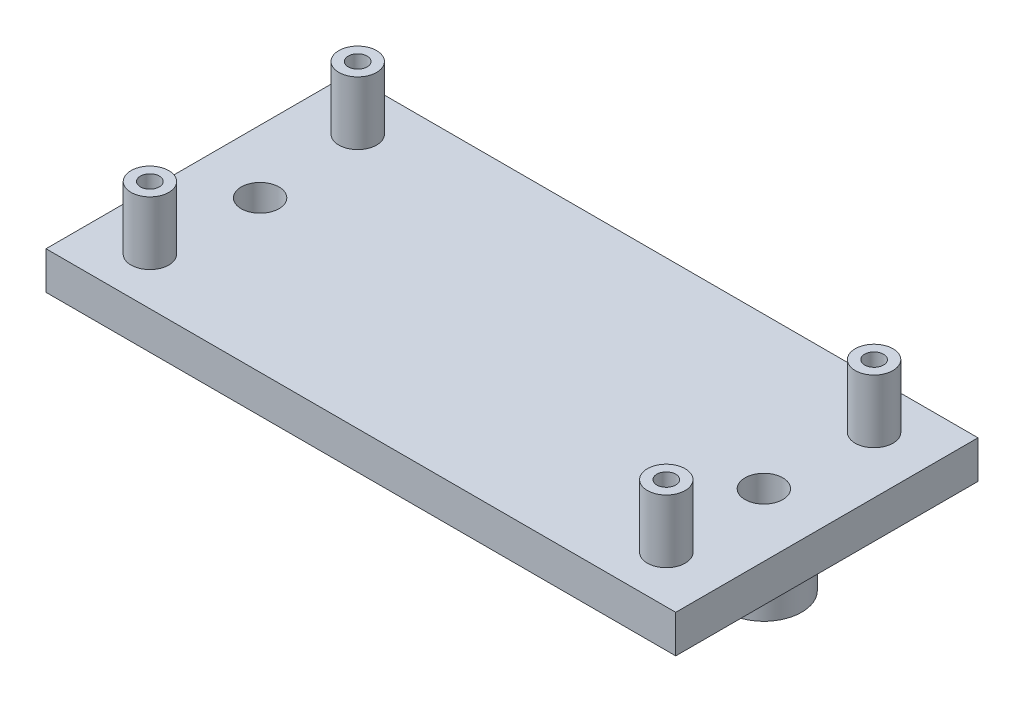
ISO-10303-21;
HEADER;
FILE_DESCRIPTION(('STEP AP214'),'2;1');
FILE_NAME('part.step','',(''),(''),'','','');
FILE_SCHEMA(('AUTOMOTIVE_DESIGN { 1 0 10303 214 1 1 1 1 }'));
ENDSEC;
DATA;
#1=APPLICATION_CONTEXT('core data for automotive mechanical design processes');
#2=APPLICATION_PROTOCOL_DEFINITION('international standard','automotive_design',2000,#1);
#3=PRODUCT_CONTEXT('',#1,'mechanical');
#4=PRODUCT('Part','Part','',(#3));
#5=PRODUCT_RELATED_PRODUCT_CATEGORY('part','',(#4));
#6=PRODUCT_DEFINITION_FORMATION('','',#4);
#7=PRODUCT_DEFINITION_CONTEXT('part definition',#1,'design');
#8=PRODUCT_DEFINITION('design','',#6,#7);
#9=PRODUCT_DEFINITION_SHAPE('','',#8);
#10=(LENGTH_UNIT() NAMED_UNIT(*) SI_UNIT(.MILLI.,.METRE.));
#11=(NAMED_UNIT(*) PLANE_ANGLE_UNIT() SI_UNIT($,.RADIAN.));
#12=(NAMED_UNIT(*) SI_UNIT($,.STERADIAN.) SOLID_ANGLE_UNIT());
#13=UNCERTAINTY_MEASURE_WITH_UNIT(LENGTH_MEASURE(1.E-05),#10,'distance_accuracy_value','');
#14=(GEOMETRIC_REPRESENTATION_CONTEXT(3) GLOBAL_UNCERTAINTY_ASSIGNED_CONTEXT((#13)) GLOBAL_UNIT_ASSIGNED_CONTEXT((#10,
#11,#12)) REPRESENTATION_CONTEXT('',''));
#15=CARTESIAN_POINT('',(0.,0.,0.));
#16=DIRECTION('',(0.,0.,1.));
#17=DIRECTION('',(1.,0.,0.));
#18=AXIS2_PLACEMENT_3D('',#15,#16,#17);
#19=CARTESIAN_POINT('',(0.,3.,0.));
#20=DIRECTION('',(1.,0.,0.));
#21=DIRECTION('',(0.,0.,-1.));
#22=AXIS2_PLACEMENT_3D('',#19,#20,#21);
#23=PLANE('',#22);
#24=DIRECTION('',(0.,0.,1.));
#25=VECTOR('',#24,1.);
#26=CARTESIAN_POINT('',(0.,0.,0.));
#27=LINE('',#26,#25);
#28=CARTESIAN_POINT('',(0.,0.,0.));
#29=VERTEX_POINT('',#28);
#30=CARTESIAN_POINT('',(0.,0.,24.));
#31=VERTEX_POINT('',#30);
#32=EDGE_CURVE('E102',#29,#31,#27,.T.);
#33=ORIENTED_EDGE('',*,*,#32,.T.);
#34=DIRECTION('',(0.,-1.,0.));
#35=VECTOR('',#34,1.);
#36=CARTESIAN_POINT('',(0.,3.,24.));
#37=LINE('',#36,#35);
#38=CARTESIAN_POINT('',(0.,3.,24.));
#39=VERTEX_POINT('',#38);
#40=EDGE_CURVE('E93',#39,#31,#37,.T.);
#41=ORIENTED_EDGE('',*,*,#40,.F.);
#42=DIRECTION('',(0.,0.,1.));
#43=VECTOR('',#42,1.);
#44=CARTESIAN_POINT('',(0.,3.,0.));
#45=LINE('',#44,#43);
#46=CARTESIAN_POINT('',(0.,3.,0.));
#47=VERTEX_POINT('',#46);
#48=EDGE_CURVE('E87',#47,#39,#45,.T.);
#49=ORIENTED_EDGE('',*,*,#48,.F.);
#50=DIRECTION('',(0.,-1.,0.));
#51=VECTOR('',#50,1.);
#52=CARTESIAN_POINT('',(0.,3.,0.));
#53=LINE('',#52,#51);
#54=EDGE_CURVE('E98',#47,#29,#53,.T.);
#55=ORIENTED_EDGE('',*,*,#54,.T.);
#56=EDGE_LOOP('',(#33,#41,#49,#55));
#57=FACE_BOUND('',#56,.T.);
#58=ADVANCED_FACE('F33',(#57),#23,.F.);
#59=CARTESIAN_POINT('',(0.,3.,24.));
#60=DIRECTION('',(0.,0.,-1.));
#61=DIRECTION('',(-1.,0.,0.));
#62=AXIS2_PLACEMENT_3D('',#59,#60,#61);
#63=PLANE('',#62);
#64=DIRECTION('',(1.,0.,0.));
#65=VECTOR('',#64,1.);
#66=CARTESIAN_POINT('',(0.,0.,24.));
#67=LINE('',#66,#65);
#68=CARTESIAN_POINT('',(50.,0.,24.));
#69=VERTEX_POINT('',#68);
#70=EDGE_CURVE('E92',#31,#69,#67,.T.);
#71=ORIENTED_EDGE('',*,*,#70,.T.);
#72=DIRECTION('',(0.,-1.,0.));
#73=VECTOR('',#72,1.);
#74=CARTESIAN_POINT('',(50.,3.,24.));
#75=LINE('',#74,#73);
#76=CARTESIAN_POINT('',(50.,3.,24.));
#77=VERTEX_POINT('',#76);
#78=EDGE_CURVE('E90',#77,#69,#75,.T.);
#79=ORIENTED_EDGE('',*,*,#78,.F.);
#80=DIRECTION('',(1.,0.,0.));
#81=VECTOR('',#80,1.);
#82=CARTESIAN_POINT('',(0.,3.,24.));
#83=LINE('',#82,#81);
#84=EDGE_CURVE('E82',#39,#77,#83,.T.);
#85=ORIENTED_EDGE('',*,*,#84,.F.);
#86=ORIENTED_EDGE('',*,*,#40,.T.);
#87=EDGE_LOOP('',(#71,#79,#85,#86));
#88=FACE_BOUND('',#87,.T.);
#89=ADVANCED_FACE('F91',(#88),#63,.F.);
#90=CARTESIAN_POINT('',(50.,3.,0.));
#91=DIRECTION('',(-1.,0.,0.));
#92=DIRECTION('',(0.,0.,1.));
#93=AXIS2_PLACEMENT_3D('',#90,#91,#92);
#94=PLANE('',#93);
#95=DIRECTION('',(0.,0.,-1.));
#96=VECTOR('',#95,1.);
#97=CARTESIAN_POINT('',(50.,0.,0.));
#98=LINE('',#97,#96);
#99=CARTESIAN_POINT('',(50.,0.,0.));
#100=VERTEX_POINT('',#99);
#101=EDGE_CURVE('E68',#69,#100,#98,.T.);
#102=ORIENTED_EDGE('',*,*,#101,.T.);
#103=DIRECTION('',(0.,-1.,0.));
#104=VECTOR('',#103,1.);
#105=CARTESIAN_POINT('',(50.,3.,0.));
#106=LINE('',#105,#104);
#107=CARTESIAN_POINT('',(50.,3.,0.));
#108=VERTEX_POINT('',#107);
#109=EDGE_CURVE('E94',#108,#100,#106,.T.);
#110=ORIENTED_EDGE('',*,*,#109,.F.);
#111=DIRECTION('',(0.,0.,-1.));
#112=VECTOR('',#111,1.);
#113=CARTESIAN_POINT('',(50.,3.,0.));
#114=LINE('',#113,#112);
#115=EDGE_CURVE('E85',#77,#108,#114,.T.);
#116=ORIENTED_EDGE('',*,*,#115,.F.);
#117=ORIENTED_EDGE('',*,*,#78,.T.);
#118=EDGE_LOOP('',(#102,#110,#116,#117));
#119=FACE_BOUND('',#118,.T.);
#120=ADVANCED_FACE('F96',(#119),#94,.F.);
#121=CARTESIAN_POINT('',(0.,3.,0.));
#122=DIRECTION('',(0.,0.,1.));
#123=DIRECTION('',(1.,0.,0.));
#124=AXIS2_PLACEMENT_3D('',#121,#122,#123);
#125=PLANE('',#124);
#126=DIRECTION('',(-1.,0.,0.));
#127=VECTOR('',#126,1.);
#128=CARTESIAN_POINT('',(0.,0.,0.));
#129=LINE('',#128,#127);
#130=EDGE_CURVE('E74',#100,#29,#129,.T.);
#131=ORIENTED_EDGE('',*,*,#130,.T.);
#132=ORIENTED_EDGE('',*,*,#54,.F.);
#133=DIRECTION('',(-1.,0.,0.));
#134=VECTOR('',#133,1.);
#135=CARTESIAN_POINT('',(0.,3.,0.));
#136=LINE('',#135,#134);
#137=EDGE_CURVE('E51',#108,#47,#136,.T.);
#138=ORIENTED_EDGE('',*,*,#137,.F.);
#139=ORIENTED_EDGE('',*,*,#109,.T.);
#140=EDGE_LOOP('',(#131,#132,#138,#139));
#141=FACE_BOUND('',#140,.T.);
#142=ADVANCED_FACE('F224',(#141),#125,.F.);
#143=CARTESIAN_POINT('',(0.,3.,0.));
#144=DIRECTION('',(0.,1.,0.));
#145=DIRECTION('',(0.,0.,1.));
#146=AXIS2_PLACEMENT_3D('',#143,#144,#145);
#147=PLANE('',#146);
#148=CARTESIAN_POINT('',(5.,3.,12.));
#149=DIRECTION('',(0.,1.,0.));
#150=DIRECTION('',(0.,0.,1.));
#151=AXIS2_PLACEMENT_3D('',#148,#149,#150);
#152=CIRCLE('',#151,1.5);
#153=CARTESIAN_POINT('',(5.,3.,13.5));
#154=VERTEX_POINT('',#153);
#155=EDGE_CURVE('E36',#154,#154,#152,.T.);
#156=ORIENTED_EDGE('',*,*,#155,.F.);
#157=EDGE_LOOP('',(#156));
#158=FACE_BOUND('',#157,.T.);
#159=CARTESIAN_POINT('',(45.,3.,12.));
#160=DIRECTION('',(0.,1.,0.));
#161=DIRECTION('',(0.,0.,1.));
#162=AXIS2_PLACEMENT_3D('',#159,#160,#161);
#163=CIRCLE('',#162,1.5);
#164=CARTESIAN_POINT('',(45.,3.,13.5));
#165=VERTEX_POINT('',#164);
#166=EDGE_CURVE('E127',#165,#165,#163,.T.);
#167=ORIENTED_EDGE('',*,*,#166,.F.);
#168=EDGE_LOOP('',(#167));
#169=FACE_BOUND('',#168,.T.);
#170=CARTESIAN_POINT('',(45.5,3.,20.25));
#171=DIRECTION('',(0.,1.,0.));
#172=DIRECTION('',(0.,0.,1.));
#173=AXIS2_PLACEMENT_3D('',#170,#171,#172);
#174=CIRCLE('',#173,1.5);
#175=CARTESIAN_POINT('',(45.5,3.,21.75));
#176=VERTEX_POINT('',#175);
#177=EDGE_CURVE('E141',#176,#176,#174,.T.);
#178=ORIENTED_EDGE('',*,*,#177,.F.);
#179=EDGE_LOOP('',(#178));
#180=FACE_BOUND('',#179,.T.);
#181=CARTESIAN_POINT('',(4.5,3.,20.25));
#182=DIRECTION('',(0.,1.,0.));
#183=DIRECTION('',(0.,0.,1.));
#184=AXIS2_PLACEMENT_3D('',#181,#182,#183);
#185=CIRCLE('',#184,1.5);
#186=CARTESIAN_POINT('',(4.5,3.,21.75));
#187=VERTEX_POINT('',#186);
#188=EDGE_CURVE('E156',#187,#187,#185,.T.);
#189=ORIENTED_EDGE('',*,*,#188,.F.);
#190=EDGE_LOOP('',(#189));
#191=FACE_BOUND('',#190,.T.);
#192=CARTESIAN_POINT('',(45.5,3.,3.74999999999999));
#193=DIRECTION('',(0.,1.,0.));
#194=DIRECTION('',(0.,0.,1.));
#195=AXIS2_PLACEMENT_3D('',#192,#193,#194);
#196=CIRCLE('',#195,1.5);
#197=CARTESIAN_POINT('',(45.5,3.,5.25));
#198=VERTEX_POINT('',#197);
#199=EDGE_CURVE('E171',#198,#198,#196,.T.);
#200=ORIENTED_EDGE('',*,*,#199,.F.);
#201=EDGE_LOOP('',(#200));
#202=FACE_BOUND('',#201,.T.);
#203=CARTESIAN_POINT('',(4.5,3.,3.74999999999999));
#204=DIRECTION('',(0.,1.,0.));
#205=DIRECTION('',(0.,0.,1.));
#206=AXIS2_PLACEMENT_3D('',#203,#204,#205);
#207=CIRCLE('',#206,1.5);
#208=CARTESIAN_POINT('',(4.5,3.,5.24999999999999));
#209=VERTEX_POINT('',#208);
#210=EDGE_CURVE('E186',#209,#209,#207,.T.);
#211=ORIENTED_EDGE('',*,*,#210,.F.);
#212=EDGE_LOOP('',(#211));
#213=FACE_BOUND('',#212,.T.);
#214=ORIENTED_EDGE('',*,*,#48,.T.);
#215=ORIENTED_EDGE('',*,*,#84,.T.);
#216=ORIENTED_EDGE('',*,*,#115,.T.);
#217=ORIENTED_EDGE('',*,*,#137,.T.);
#218=EDGE_LOOP('',(#214,#215,#216,#217));
#219=FACE_BOUND('',#218,.T.);
#220=ADVANCED_FACE('F83',(#158,#169,#180,#191,#202,#213,#219),#147,.T.);
#221=CARTESIAN_POINT('',(0.,0.,0.));
#222=DIRECTION('',(0.,1.,0.));
#223=DIRECTION('',(0.,0.,1.));
#224=AXIS2_PLACEMENT_3D('',#221,#222,#223);
#225=PLANE('',#224);
#226=CARTESIAN_POINT('',(4.5,0.,20.25));
#227=DIRECTION('',(0.,1.,0.));
#228=DIRECTION('',(0.,0.,1.));
#229=AXIS2_PLACEMENT_3D('',#226,#227,#228);
#230=CIRCLE('',#229,0.9);
#231=CARTESIAN_POINT('',(4.5,0.,21.15));
#232=VERTEX_POINT('',#231);
#233=EDGE_CURVE('E124',#232,#232,#230,.T.);
#234=ORIENTED_EDGE('',*,*,#233,.T.);
#235=EDGE_LOOP('',(#234));
#236=FACE_BOUND('',#235,.T.);
#237=CARTESIAN_POINT('',(45.5,0.,20.25));
#238=DIRECTION('',(0.,1.,0.));
#239=DIRECTION('',(0.,0.,1.));
#240=AXIS2_PLACEMENT_3D('',#237,#238,#239);
#241=CIRCLE('',#240,0.899999999999996);
#242=CARTESIAN_POINT('',(45.5,0.,21.15));
#243=VERTEX_POINT('',#242);
#244=EDGE_CURVE('E121',#243,#243,#241,.T.);
#245=ORIENTED_EDGE('',*,*,#244,.T.);
#246=EDGE_LOOP('',(#245));
#247=FACE_BOUND('',#246,.T.);
#248=CARTESIAN_POINT('',(45.5,0.,3.74999999999999));
#249=DIRECTION('',(0.,1.,0.));
#250=DIRECTION('',(0.,0.,1.));
#251=AXIS2_PLACEMENT_3D('',#248,#249,#250);
#252=CIRCLE('',#251,0.899999999999997);
#253=CARTESIAN_POINT('',(45.5,0.,4.64999999999999));
#254=VERTEX_POINT('',#253);
#255=EDGE_CURVE('E117',#254,#254,#252,.T.);
#256=ORIENTED_EDGE('',*,*,#255,.T.);
#257=EDGE_LOOP('',(#256));
#258=FACE_BOUND('',#257,.T.);
#259=CARTESIAN_POINT('',(4.5,0.,3.74999999999999));
#260=DIRECTION('',(0.,1.,0.));
#261=DIRECTION('',(0.,0.,1.));
#262=AXIS2_PLACEMENT_3D('',#259,#260,#261);
#263=CIRCLE('',#262,0.9);
#264=CARTESIAN_POINT('',(4.5,0.,4.64999999999999));
#265=VERTEX_POINT('',#264);
#266=EDGE_CURVE('E114',#265,#265,#263,.T.);
#267=ORIENTED_EDGE('',*,*,#266,.T.);
#268=EDGE_LOOP('',(#267));
#269=FACE_BOUND('',#268,.T.);
#270=CARTESIAN_POINT('',(45.,0.,12.));
#271=DIRECTION('',(0.,1.,0.));
#272=DIRECTION('',(0.,0.,1.));
#273=AXIS2_PLACEMENT_3D('',#270,#271,#272);
#274=CIRCLE('',#273,3.);
#275=CARTESIAN_POINT('',(45.,0.,15.));
#276=VERTEX_POINT('',#275);
#277=EDGE_CURVE('E11',#276,#276,#274,.F.);
#278=ORIENTED_EDGE('',*,*,#277,.F.);
#279=EDGE_LOOP('',(#278));
#280=FACE_BOUND('',#279,.T.);
#281=CARTESIAN_POINT('',(5.,0.,12.));
#282=DIRECTION('',(0.,1.,0.));
#283=DIRECTION('',(0.,0.,1.));
#284=AXIS2_PLACEMENT_3D('',#281,#282,#283);
#285=CIRCLE('',#284,3.);
#286=CARTESIAN_POINT('',(5.,0.,15.));
#287=VERTEX_POINT('',#286);
#288=EDGE_CURVE('E42',#287,#287,#285,.F.);
#289=ORIENTED_EDGE('',*,*,#288,.F.);
#290=EDGE_LOOP('',(#289));
#291=FACE_BOUND('',#290,.T.);
#292=ORIENTED_EDGE('',*,*,#32,.F.);
#293=ORIENTED_EDGE('',*,*,#130,.F.);
#294=ORIENTED_EDGE('',*,*,#101,.F.);
#295=ORIENTED_EDGE('',*,*,#70,.F.);
#296=EDGE_LOOP('',(#292,#293,#294,#295));
#297=FACE_BOUND('',#296,.T.);
#298=ADVANCED_FACE('F217',(#236,#247,#258,#269,#280,#291,#297),#225,.F.);
#299=CARTESIAN_POINT('',(5.,-4.,12.));
#300=DIRECTION('',(0.,-1.,0.));
#301=DIRECTION('',(0.,0.,-1.));
#302=AXIS2_PLACEMENT_3D('',#299,#300,#301);
#303=PLANE('',#302);
#304=CARTESIAN_POINT('',(5.,-4.,12.));
#305=DIRECTION('',(0.,-1.,0.));
#306=DIRECTION('',(0.,0.,-1.));
#307=AXIS2_PLACEMENT_3D('',#304,#305,#306);
#308=CIRCLE('',#307,3.);
#309=CARTESIAN_POINT('',(5.,-4.,9.));
#310=VERTEX_POINT('',#309);
#311=EDGE_CURVE('E105',#310,#310,#308,.T.);
#312=ORIENTED_EDGE('',*,*,#311,.T.);
#313=EDGE_LOOP('',(#312));
#314=FACE_BOUND('',#313,.T.);
#315=CARTESIAN_POINT('',(5.,-4.,12.));
#316=DIRECTION('',(0.,-1.,0.));
#317=DIRECTION('',(0.,0.,-1.));
#318=AXIS2_PLACEMENT_3D('',#315,#316,#317);
#319=CIRCLE('',#318,1.5);
#320=CARTESIAN_POINT('',(5.,-4.,10.5));
#321=VERTEX_POINT('',#320);
#322=EDGE_CURVE('E201',#321,#321,#319,.T.);
#323=ORIENTED_EDGE('',*,*,#322,.F.);
#324=EDGE_LOOP('',(#323));
#325=FACE_BOUND('',#324,.T.);
#326=ADVANCED_FACE('F207',(#314,#325),#303,.T.);
#327=CARTESIAN_POINT('',(5.,-4.,12.));
#328=DIRECTION('',(0.,1.,0.));
#329=DIRECTION('',(0.,0.,1.));
#330=AXIS2_PLACEMENT_3D('',#327,#328,#329);
#331=CYLINDRICAL_SURFACE('',#330,3.);
#332=ORIENTED_EDGE('',*,*,#311,.F.);
#333=EDGE_LOOP('',(#332));
#334=FACE_BOUND('',#333,.T.);
#335=ORIENTED_EDGE('',*,*,#288,.T.);
#336=EDGE_LOOP('',(#335));
#337=FACE_BOUND('',#336,.T.);
#338=ADVANCED_FACE('F210',(#334,#337),#331,.T.);
#339=CARTESIAN_POINT('',(5.,-4.,12.));
#340=DIRECTION('',(0.,1.,0.));
#341=DIRECTION('',(0.,0.,1.));
#342=AXIS2_PLACEMENT_3D('',#339,#340,#341);
#343=CYLINDRICAL_SURFACE('',#342,1.5);
#344=ORIENTED_EDGE('',*,*,#322,.T.);
#345=EDGE_LOOP('',(#344));
#346=FACE_BOUND('',#345,.T.);
#347=ORIENTED_EDGE('',*,*,#155,.T.);
#348=EDGE_LOOP('',(#347));
#349=FACE_BOUND('',#348,.T.);
#350=ADVANCED_FACE('F213',(#346,#349),#343,.F.);
#351=CARTESIAN_POINT('',(45.,-4.,12.));
#352=DIRECTION('',(0.,1.,0.));
#353=DIRECTION('',(0.,0.,1.));
#354=AXIS2_PLACEMENT_3D('',#351,#352,#353);
#355=PLANE('',#354);
#356=CARTESIAN_POINT('',(45.,-4.,12.));
#357=DIRECTION('',(0.,-1.,0.));
#358=DIRECTION('',(0.,0.,1.));
#359=AXIS2_PLACEMENT_3D('',#356,#357,#358);
#360=CIRCLE('',#359,3.);
#361=CARTESIAN_POINT('',(45.,-4.,15.));
#362=VERTEX_POINT('',#361);
#363=EDGE_CURVE('E198',#362,#362,#360,.T.);
#364=ORIENTED_EDGE('',*,*,#363,.T.);
#365=EDGE_LOOP('',(#364));
#366=FACE_BOUND('',#365,.T.);
#367=CARTESIAN_POINT('',(45.,-4.,12.));
#368=DIRECTION('',(0.,-1.,0.));
#369=DIRECTION('',(0.,0.,1.));
#370=AXIS2_PLACEMENT_3D('',#367,#368,#369);
#371=CIRCLE('',#370,1.5);
#372=CARTESIAN_POINT('',(45.,-4.,13.5));
#373=VERTEX_POINT('',#372);
#374=EDGE_CURVE('E126',#373,#373,#371,.T.);
#375=ORIENTED_EDGE('',*,*,#374,.F.);
#376=EDGE_LOOP('',(#375));
#377=FACE_BOUND('',#376,.T.);
#378=ADVANCED_FACE('F271',(#366,#377),#355,.F.);
#379=CARTESIAN_POINT('',(45.,-4.,12.));
#380=DIRECTION('',(0.,1.,0.));
#381=DIRECTION('',(0.,0.,1.));
#382=AXIS2_PLACEMENT_3D('',#379,#380,#381);
#383=CYLINDRICAL_SURFACE('',#382,3.);
#384=ORIENTED_EDGE('',*,*,#363,.F.);
#385=EDGE_LOOP('',(#384));
#386=FACE_BOUND('',#385,.T.);
#387=ORIENTED_EDGE('',*,*,#277,.T.);
#388=EDGE_LOOP('',(#387));
#389=FACE_BOUND('',#388,.T.);
#390=ADVANCED_FACE('F276',(#386,#389),#383,.T.);
#391=CARTESIAN_POINT('',(45.,-4.,12.));
#392=DIRECTION('',(0.,1.,0.));
#393=DIRECTION('',(0.,0.,1.));
#394=AXIS2_PLACEMENT_3D('',#391,#392,#393);
#395=CYLINDRICAL_SURFACE('',#394,1.5);
#396=ORIENTED_EDGE('',*,*,#374,.T.);
#397=EDGE_LOOP('',(#396));
#398=FACE_BOUND('',#397,.T.);
#399=ORIENTED_EDGE('',*,*,#166,.T.);
#400=EDGE_LOOP('',(#399));
#401=FACE_BOUND('',#400,.T.);
#402=ADVANCED_FACE('F286',(#398,#401),#395,.F.);
#403=CARTESIAN_POINT('',(4.5,-7.,3.74999999999999));
#404=DIRECTION('',(0.,1.,0.));
#405=DIRECTION('',(0.,0.,1.));
#406=AXIS2_PLACEMENT_3D('',#403,#404,#405);
#407=CYLINDRICAL_SURFACE('',#406,0.9);
#408=CARTESIAN_POINT('',(4.5,3.,3.74999999999999));
#409=DIRECTION('',(0.,1.,0.));
#410=DIRECTION('',(0.,0.,1.));
#411=AXIS2_PLACEMENT_3D('',#408,#409,#410);
#412=CIRCLE('',#411,0.9);
#413=CARTESIAN_POINT('',(4.5,3.,4.64999999999999));
#414=VERTEX_POINT('',#413);
#415=EDGE_CURVE('E118',#414,#414,#412,.F.);
#416=ORIENTED_EDGE('',*,*,#415,.F.);
#417=EDGE_LOOP('',(#416));
#418=FACE_BOUND('',#417,.T.);
#419=ORIENTED_EDGE('',*,*,#266,.F.);
#420=EDGE_LOOP('',(#419));
#421=FACE_BOUND('',#420,.T.);
#422=ADVANCED_FACE('F299',(#418,#421),#407,.F.);
#423=CARTESIAN_POINT('',(45.5,-7.,3.74999999999999));
#424=DIRECTION('',(0.,1.,0.));
#425=DIRECTION('',(0.,0.,1.));
#426=AXIS2_PLACEMENT_3D('',#423,#424,#425);
#427=CYLINDRICAL_SURFACE('',#426,0.899999999999997);
#428=CARTESIAN_POINT('',(45.5,3.,3.74999999999999));
#429=DIRECTION('',(0.,1.,0.));
#430=DIRECTION('',(0.,0.,1.));
#431=AXIS2_PLACEMENT_3D('',#428,#429,#430);
#432=CIRCLE('',#431,0.899999999999997);
#433=CARTESIAN_POINT('',(45.5,3.,4.64999999999999));
#434=VERTEX_POINT('',#433);
#435=EDGE_CURVE('E177',#434,#434,#432,.F.);
#436=ORIENTED_EDGE('',*,*,#435,.F.);
#437=EDGE_LOOP('',(#436));
#438=FACE_BOUND('',#437,.T.);
#439=ORIENTED_EDGE('',*,*,#255,.F.);
#440=EDGE_LOOP('',(#439));
#441=FACE_BOUND('',#440,.T.);
#442=ADVANCED_FACE('F304',(#438,#441),#427,.F.);
#443=CARTESIAN_POINT('',(45.5,-7.,20.25));
#444=DIRECTION('',(0.,1.,0.));
#445=DIRECTION('',(0.,0.,1.));
#446=AXIS2_PLACEMENT_3D('',#443,#444,#445);
#447=CYLINDRICAL_SURFACE('',#446,0.899999999999996);
#448=CARTESIAN_POINT('',(45.5,3.,20.25));
#449=DIRECTION('',(0.,1.,0.));
#450=DIRECTION('',(0.,0.,1.));
#451=AXIS2_PLACEMENT_3D('',#448,#449,#450);
#452=CIRCLE('',#451,0.899999999999996);
#453=CARTESIAN_POINT('',(45.5,3.,21.15));
#454=VERTEX_POINT('',#453);
#455=EDGE_CURVE('E147',#454,#454,#452,.F.);
#456=ORIENTED_EDGE('',*,*,#455,.F.);
#457=EDGE_LOOP('',(#456));
#458=FACE_BOUND('',#457,.T.);
#459=ORIENTED_EDGE('',*,*,#244,.F.);
#460=EDGE_LOOP('',(#459));
#461=FACE_BOUND('',#460,.T.);
#462=ADVANCED_FACE('F314',(#458,#461),#447,.F.);
#463=CARTESIAN_POINT('',(4.5,-7.,20.25));
#464=DIRECTION('',(0.,1.,0.));
#465=DIRECTION('',(0.,0.,1.));
#466=AXIS2_PLACEMENT_3D('',#463,#464,#465);
#467=CYLINDRICAL_SURFACE('',#466,0.9);
#468=CARTESIAN_POINT('',(4.5,3.,20.25));
#469=DIRECTION('',(0.,1.,0.));
#470=DIRECTION('',(0.,0.,1.));
#471=AXIS2_PLACEMENT_3D('',#468,#469,#470);
#472=CIRCLE('',#471,0.9);
#473=CARTESIAN_POINT('',(4.5,3.,21.15));
#474=VERTEX_POINT('',#473);
#475=EDGE_CURVE('E162',#474,#474,#472,.F.);
#476=ORIENTED_EDGE('',*,*,#475,.F.);
#477=EDGE_LOOP('',(#476));
#478=FACE_BOUND('',#477,.T.);
#479=ORIENTED_EDGE('',*,*,#233,.F.);
#480=EDGE_LOOP('',(#479));
#481=FACE_BOUND('',#480,.T.);
#482=ADVANCED_FACE('F324',(#478,#481),#467,.F.);
#483=CARTESIAN_POINT('',(4.5,3.,3.74999999999999));
#484=DIRECTION('',(0.,1.,0.));
#485=DIRECTION('',(0.,0.,1.));
#486=AXIS2_PLACEMENT_3D('',#483,#484,#485);
#487=PLANE('',#486);
#488=CARTESIAN_POINT('',(4.5,3.,3.74999999999999));
#489=DIRECTION('',(0.,1.,0.));
#490=DIRECTION('',(0.,0.,1.));
#491=AXIS2_PLACEMENT_3D('',#488,#489,#490);
#492=CIRCLE('',#491,0.75);
#493=CARTESIAN_POINT('',(4.5,3.,4.49999999999999));
#494=VERTEX_POINT('',#493);
#495=EDGE_CURVE('E182',#494,#494,#492,.T.);
#496=ORIENTED_EDGE('',*,*,#495,.T.);
#497=EDGE_LOOP('',(#496));
#498=FACE_BOUND('',#497,.T.);
#499=ORIENTED_EDGE('',*,*,#415,.T.);
#500=EDGE_LOOP('',(#499));
#501=FACE_BOUND('',#500,.T.);
#502=ADVANCED_FACE('F334',(#498,#501),#487,.F.);
#503=CARTESIAN_POINT('',(4.5,8.,3.74999999999999));
#504=DIRECTION('',(0.,1.,0.));
#505=DIRECTION('',(0.,0.,1.));
#506=AXIS2_PLACEMENT_3D('',#503,#504,#505);
#507=PLANE('',#506);
#508=CARTESIAN_POINT('',(4.5,8.,3.74999999999999));
#509=DIRECTION('',(0.,1.,0.));
#510=DIRECTION('',(0.,0.,1.));
#511=AXIS2_PLACEMENT_3D('',#508,#509,#510);
#512=CIRCLE('',#511,1.5);
#513=CARTESIAN_POINT('',(4.5,8.,5.24999999999999));
#514=VERTEX_POINT('',#513);
#515=EDGE_CURVE('E189',#514,#514,#512,.T.);
#516=ORIENTED_EDGE('',*,*,#515,.T.);
#517=EDGE_LOOP('',(#516));
#518=FACE_BOUND('',#517,.T.);
#519=CARTESIAN_POINT('',(4.5,8.,3.74999999999999));
#520=DIRECTION('',(0.,1.,0.));
#521=DIRECTION('',(0.,0.,1.));
#522=AXIS2_PLACEMENT_3D('',#519,#520,#521);
#523=CIRCLE('',#522,0.75);
#524=CARTESIAN_POINT('',(4.5,8.,4.49999999999999));
#525=VERTEX_POINT('',#524);
#526=EDGE_CURVE('E183',#525,#525,#523,.T.);
#527=ORIENTED_EDGE('',*,*,#526,.F.);
#528=EDGE_LOOP('',(#527));
#529=FACE_BOUND('',#528,.T.);
#530=ADVANCED_FACE('F344',(#518,#529),#507,.T.);
#531=CARTESIAN_POINT('',(4.5,8.,3.74999999999999));
#532=DIRECTION('',(0.,-1.,0.));
#533=DIRECTION('',(0.,0.,-1.));
#534=AXIS2_PLACEMENT_3D('',#531,#532,#533);
#535=CYLINDRICAL_SURFACE('',#534,1.5);
#536=ORIENTED_EDGE('',*,*,#515,.F.);
#537=EDGE_LOOP('',(#536));
#538=FACE_BOUND('',#537,.T.);
#539=ORIENTED_EDGE('',*,*,#210,.T.);
#540=EDGE_LOOP('',(#539));
#541=FACE_BOUND('',#540,.T.);
#542=ADVANCED_FACE('F354',(#538,#541),#535,.T.);
#543=CARTESIAN_POINT('',(4.5,8.,3.74999999999999));
#544=DIRECTION('',(0.,-1.,0.));
#545=DIRECTION('',(0.,0.,-1.));
#546=AXIS2_PLACEMENT_3D('',#543,#544,#545);
#547=CYLINDRICAL_SURFACE('',#546,0.75);
#548=ORIENTED_EDGE('',*,*,#526,.T.);
#549=EDGE_LOOP('',(#548));
#550=FACE_BOUND('',#549,.T.);
#551=ORIENTED_EDGE('',*,*,#495,.F.);
#552=EDGE_LOOP('',(#551));
#553=FACE_BOUND('',#552,.T.);
#554=ADVANCED_FACE('F364',(#550,#553),#547,.F.);
#555=CARTESIAN_POINT('',(45.5,3.,3.74999999999999));
#556=DIRECTION('',(0.,1.,0.));
#557=DIRECTION('',(0.,0.,1.));
#558=AXIS2_PLACEMENT_3D('',#555,#556,#557);
#559=PLANE('',#558);
#560=CARTESIAN_POINT('',(45.5,3.,3.74999999999999));
#561=DIRECTION('',(0.,1.,0.));
#562=DIRECTION('',(0.,0.,1.));
#563=AXIS2_PLACEMENT_3D('',#560,#561,#562);
#564=CIRCLE('',#563,0.749999999999999);
#565=CARTESIAN_POINT('',(45.5,3.,4.49999999999999));
#566=VERTEX_POINT('',#565);
#567=EDGE_CURVE('E167',#566,#566,#564,.T.);
#568=ORIENTED_EDGE('',*,*,#567,.T.);
#569=EDGE_LOOP('',(#568));
#570=FACE_BOUND('',#569,.T.);
#571=ORIENTED_EDGE('',*,*,#435,.T.);
#572=EDGE_LOOP('',(#571));
#573=FACE_BOUND('',#572,.T.);
#574=ADVANCED_FACE('F374',(#570,#573),#559,.F.);
#575=CARTESIAN_POINT('',(45.5,8.,3.74999999999999));
#576=DIRECTION('',(0.,1.,0.));
#577=DIRECTION('',(0.,0.,1.));
#578=AXIS2_PLACEMENT_3D('',#575,#576,#577);
#579=PLANE('',#578);
#580=CARTESIAN_POINT('',(45.5,8.,3.74999999999999));
#581=DIRECTION('',(0.,1.,0.));
#582=DIRECTION('',(0.,0.,1.));
#583=AXIS2_PLACEMENT_3D('',#580,#581,#582);
#584=CIRCLE('',#583,1.5);
#585=CARTESIAN_POINT('',(45.5,8.,5.25));
#586=VERTEX_POINT('',#585);
#587=EDGE_CURVE('E174',#586,#586,#584,.T.);
#588=ORIENTED_EDGE('',*,*,#587,.T.);
#589=EDGE_LOOP('',(#588));
#590=FACE_BOUND('',#589,.T.);
#591=CARTESIAN_POINT('',(45.5,8.,3.74999999999999));
#592=DIRECTION('',(0.,1.,0.));
#593=DIRECTION('',(0.,0.,1.));
#594=AXIS2_PLACEMENT_3D('',#591,#592,#593);
#595=CIRCLE('',#594,0.749999999999999);
#596=CARTESIAN_POINT('',(45.5,8.,4.49999999999999));
#597=VERTEX_POINT('',#596);
#598=EDGE_CURVE('E168',#597,#597,#595,.T.);
#599=ORIENTED_EDGE('',*,*,#598,.F.);
#600=EDGE_LOOP('',(#599));
#601=FACE_BOUND('',#600,.T.);
#602=ADVANCED_FACE('F384',(#590,#601),#579,.T.);
#603=CARTESIAN_POINT('',(45.5,8.,3.74999999999999));
#604=DIRECTION('',(0.,-1.,0.));
#605=DIRECTION('',(0.,0.,-1.));
#606=AXIS2_PLACEMENT_3D('',#603,#604,#605);
#607=CYLINDRICAL_SURFACE('',#606,1.5);
#608=ORIENTED_EDGE('',*,*,#587,.F.);
#609=EDGE_LOOP('',(#608));
#610=FACE_BOUND('',#609,.T.);
#611=ORIENTED_EDGE('',*,*,#199,.T.);
#612=EDGE_LOOP('',(#611));
#613=FACE_BOUND('',#612,.T.);
#614=ADVANCED_FACE('F394',(#610,#613),#607,.T.);
#615=CARTESIAN_POINT('',(45.5,8.,3.74999999999999));
#616=DIRECTION('',(0.,-1.,0.));
#617=DIRECTION('',(0.,0.,-1.));
#618=AXIS2_PLACEMENT_3D('',#615,#616,#617);
#619=CYLINDRICAL_SURFACE('',#618,0.749999999999999);
#620=ORIENTED_EDGE('',*,*,#598,.T.);
#621=EDGE_LOOP('',(#620));
#622=FACE_BOUND('',#621,.T.);
#623=ORIENTED_EDGE('',*,*,#567,.F.);
#624=EDGE_LOOP('',(#623));
#625=FACE_BOUND('',#624,.T.);
#626=ADVANCED_FACE('F404',(#622,#625),#619,.F.);
#627=CARTESIAN_POINT('',(4.5,3.,20.25));
#628=DIRECTION('',(0.,1.,0.));
#629=DIRECTION('',(0.,0.,1.));
#630=AXIS2_PLACEMENT_3D('',#627,#628,#629);
#631=PLANE('',#630);
#632=CARTESIAN_POINT('',(4.5,3.,20.25));
#633=DIRECTION('',(0.,1.,0.));
#634=DIRECTION('',(0.,0.,1.));
#635=AXIS2_PLACEMENT_3D('',#632,#633,#634);
#636=CIRCLE('',#635,0.75);
#637=CARTESIAN_POINT('',(4.5,3.,21.));
#638=VERTEX_POINT('',#637);
#639=EDGE_CURVE('E152',#638,#638,#636,.T.);
#640=ORIENTED_EDGE('',*,*,#639,.T.);
#641=EDGE_LOOP('',(#640));
#642=FACE_BOUND('',#641,.T.);
#643=ORIENTED_EDGE('',*,*,#475,.T.);
#644=EDGE_LOOP('',(#643));
#645=FACE_BOUND('',#644,.T.);
#646=ADVANCED_FACE('F414',(#642,#645),#631,.F.);
#647=CARTESIAN_POINT('',(4.5,8.,20.25));
#648=DIRECTION('',(0.,1.,0.));
#649=DIRECTION('',(0.,0.,1.));
#650=AXIS2_PLACEMENT_3D('',#647,#648,#649);
#651=PLANE('',#650);
#652=CARTESIAN_POINT('',(4.5,8.,20.25));
#653=DIRECTION('',(0.,1.,0.));
#654=DIRECTION('',(0.,0.,1.));
#655=AXIS2_PLACEMENT_3D('',#652,#653,#654);
#656=CIRCLE('',#655,1.5);
#657=CARTESIAN_POINT('',(4.5,8.,21.75));
#658=VERTEX_POINT('',#657);
#659=EDGE_CURVE('E159',#658,#658,#656,.T.);
#660=ORIENTED_EDGE('',*,*,#659,.T.);
#661=EDGE_LOOP('',(#660));
#662=FACE_BOUND('',#661,.T.);
#663=CARTESIAN_POINT('',(4.5,8.,20.25));
#664=DIRECTION('',(0.,1.,0.));
#665=DIRECTION('',(0.,0.,1.));
#666=AXIS2_PLACEMENT_3D('',#663,#664,#665);
#667=CIRCLE('',#666,0.75);
#668=CARTESIAN_POINT('',(4.5,8.,21.));
#669=VERTEX_POINT('',#668);
#670=EDGE_CURVE('E153',#669,#669,#667,.T.);
#671=ORIENTED_EDGE('',*,*,#670,.F.);
#672=EDGE_LOOP('',(#671));
#673=FACE_BOUND('',#672,.T.);
#674=ADVANCED_FACE('F424',(#662,#673),#651,.T.);
#675=CARTESIAN_POINT('',(4.5,8.,20.25));
#676=DIRECTION('',(0.,-1.,0.));
#677=DIRECTION('',(0.,0.,-1.));
#678=AXIS2_PLACEMENT_3D('',#675,#676,#677);
#679=CYLINDRICAL_SURFACE('',#678,1.5);
#680=ORIENTED_EDGE('',*,*,#659,.F.);
#681=EDGE_LOOP('',(#680));
#682=FACE_BOUND('',#681,.T.);
#683=ORIENTED_EDGE('',*,*,#188,.T.);
#684=EDGE_LOOP('',(#683));
#685=FACE_BOUND('',#684,.T.);
#686=ADVANCED_FACE('F434',(#682,#685),#679,.T.);
#687=CARTESIAN_POINT('',(4.5,8.,20.25));
#688=DIRECTION('',(0.,-1.,0.));
#689=DIRECTION('',(0.,0.,-1.));
#690=AXIS2_PLACEMENT_3D('',#687,#688,#689);
#691=CYLINDRICAL_SURFACE('',#690,0.75);
#692=ORIENTED_EDGE('',*,*,#670,.T.);
#693=EDGE_LOOP('',(#692));
#694=FACE_BOUND('',#693,.T.);
#695=ORIENTED_EDGE('',*,*,#639,.F.);
#696=EDGE_LOOP('',(#695));
#697=FACE_BOUND('',#696,.T.);
#698=ADVANCED_FACE('F444',(#694,#697),#691,.F.);
#699=CARTESIAN_POINT('',(45.5,3.,20.25));
#700=DIRECTION('',(0.,1.,0.));
#701=DIRECTION('',(0.,0.,1.));
#702=AXIS2_PLACEMENT_3D('',#699,#700,#701);
#703=PLANE('',#702);
#704=CARTESIAN_POINT('',(45.5,3.,20.25));
#705=DIRECTION('',(0.,1.,0.));
#706=DIRECTION('',(0.,0.,1.));
#707=AXIS2_PLACEMENT_3D('',#704,#705,#706);
#708=CIRCLE('',#707,0.749999999999999);
#709=CARTESIAN_POINT('',(45.5,3.,21.));
#710=VERTEX_POINT('',#709);
#711=EDGE_CURVE('E132',#710,#710,#708,.T.);
#712=ORIENTED_EDGE('',*,*,#711,.T.);
#713=EDGE_LOOP('',(#712));
#714=FACE_BOUND('',#713,.T.);
#715=ORIENTED_EDGE('',*,*,#455,.T.);
#716=EDGE_LOOP('',(#715));
#717=FACE_BOUND('',#716,.T.);
#718=ADVANCED_FACE('F454',(#714,#717),#703,.F.);
#719=CARTESIAN_POINT('',(45.5,8.,20.25));
#720=DIRECTION('',(0.,1.,0.));
#721=DIRECTION('',(0.,0.,1.));
#722=AXIS2_PLACEMENT_3D('',#719,#720,#721);
#723=PLANE('',#722);
#724=CARTESIAN_POINT('',(45.5,8.,20.25));
#725=DIRECTION('',(0.,1.,0.));
#726=DIRECTION('',(0.,0.,1.));
#727=AXIS2_PLACEMENT_3D('',#724,#725,#726);
#728=CIRCLE('',#727,1.5);
#729=CARTESIAN_POINT('',(45.5,8.,21.75));
#730=VERTEX_POINT('',#729);
#731=EDGE_CURVE('E144',#730,#730,#728,.T.);
#732=ORIENTED_EDGE('',*,*,#731,.T.);
#733=EDGE_LOOP('',(#732));
#734=FACE_BOUND('',#733,.T.);
#735=CARTESIAN_POINT('',(45.5,8.,20.25));
#736=DIRECTION('',(0.,1.,0.));
#737=DIRECTION('',(0.,0.,1.));
#738=AXIS2_PLACEMENT_3D('',#735,#736,#737);
#739=CIRCLE('',#738,0.749999999999999);
#740=CARTESIAN_POINT('',(45.5,8.,21.));
#741=VERTEX_POINT('',#740);
#742=EDGE_CURVE('E136',#741,#741,#739,.T.);
#743=ORIENTED_EDGE('',*,*,#742,.F.);
#744=EDGE_LOOP('',(#743));
#745=FACE_BOUND('',#744,.T.);
#746=ADVANCED_FACE('F464',(#734,#745),#723,.T.);
#747=CARTESIAN_POINT('',(45.5,8.,20.25));
#748=DIRECTION('',(0.,-1.,0.));
#749=DIRECTION('',(0.,0.,-1.));
#750=AXIS2_PLACEMENT_3D('',#747,#748,#749);
#751=CYLINDRICAL_SURFACE('',#750,1.5);
#752=ORIENTED_EDGE('',*,*,#731,.F.);
#753=EDGE_LOOP('',(#752));
#754=FACE_BOUND('',#753,.T.);
#755=ORIENTED_EDGE('',*,*,#177,.T.);
#756=EDGE_LOOP('',(#755));
#757=FACE_BOUND('',#756,.T.);
#758=ADVANCED_FACE('F473',(#754,#757),#751,.T.);
#759=CARTESIAN_POINT('',(45.5,8.,20.25));
#760=DIRECTION('',(0.,-1.,0.));
#761=DIRECTION('',(0.,0.,-1.));
#762=AXIS2_PLACEMENT_3D('',#759,#760,#761);
#763=CYLINDRICAL_SURFACE('',#762,0.749999999999999);
#764=ORIENTED_EDGE('',*,*,#742,.T.);
#765=EDGE_LOOP('',(#764));
#766=FACE_BOUND('',#765,.T.);
#767=ORIENTED_EDGE('',*,*,#711,.F.);
#768=EDGE_LOOP('',(#767));
#769=FACE_BOUND('',#768,.T.);
#770=ADVANCED_FACE('F483',(#766,#769),#763,.F.);
#771=CLOSED_SHELL('',(#58,#89,#120,#142,#220,#298,#326,#338,#350,#378,#390,#402,#422,#442,#462,
#482,#502,#530,#542,#554,#574,#602,#614,#626,#646,#674,#686,#698,#718,#746,#758,#770));
#772=MANIFOLD_SOLID_BREP('B2',#771);
#773=ADVANCED_BREP_SHAPE_REPRESENTATION('',(#18,#772),#14);
#774=SHAPE_DEFINITION_REPRESENTATION(#9,#773);
ENDSEC;
END-ISO-10303-21;
